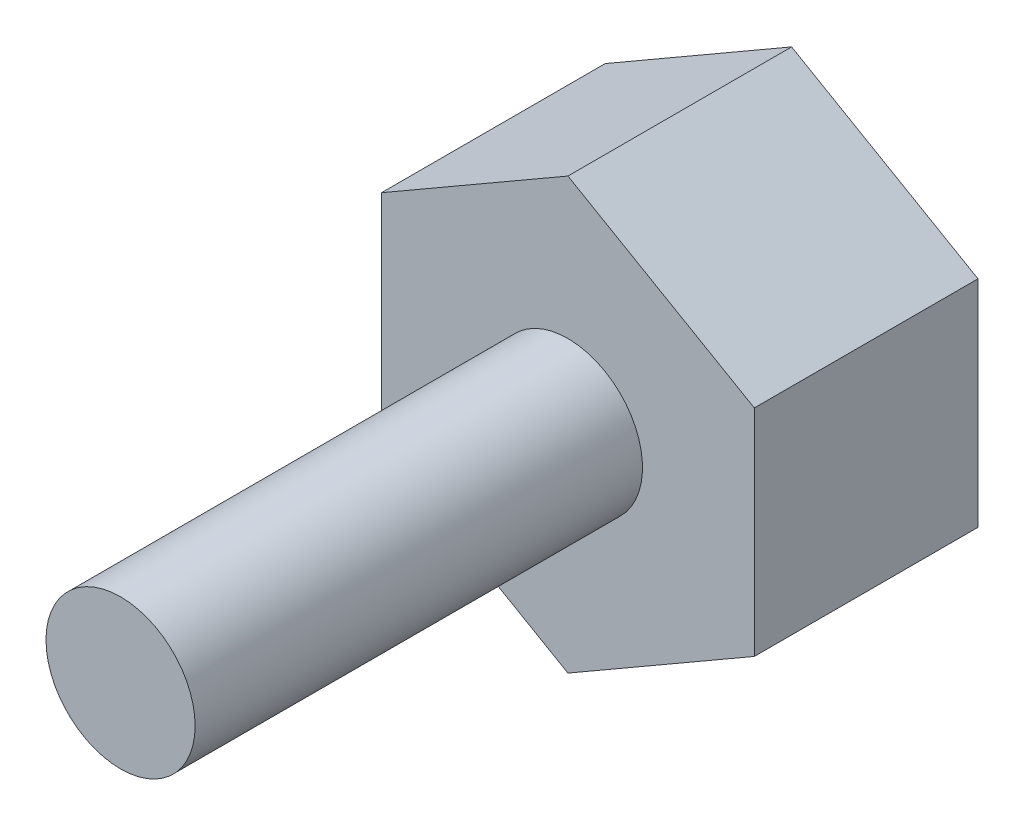
ISO-10303-21;
HEADER;
FILE_DESCRIPTION(('STEP AP214'),'2;1');
FILE_NAME('part.step','',(''),(''),'','','');
FILE_SCHEMA(('AUTOMOTIVE_DESIGN { 1 0 10303 214 1 1 1 1 }'));
ENDSEC;
DATA;
#1=APPLICATION_CONTEXT('core data for automotive mechanical design processes');
#2=APPLICATION_PROTOCOL_DEFINITION('international standard','automotive_design',2000,#1);
#3=PRODUCT_CONTEXT('',#1,'mechanical');
#4=PRODUCT('Part','Part','',(#3));
#5=PRODUCT_RELATED_PRODUCT_CATEGORY('part','',(#4));
#6=PRODUCT_DEFINITION_FORMATION('','',#4);
#7=PRODUCT_DEFINITION_CONTEXT('part definition',#1,'design');
#8=PRODUCT_DEFINITION('design','',#6,#7);
#9=PRODUCT_DEFINITION_SHAPE('','',#8);
#10=(LENGTH_UNIT() NAMED_UNIT(*) SI_UNIT(.MILLI.,.METRE.));
#11=(NAMED_UNIT(*) PLANE_ANGLE_UNIT() SI_UNIT($,.RADIAN.));
#12=(NAMED_UNIT(*) SI_UNIT($,.STERADIAN.) SOLID_ANGLE_UNIT());
#13=UNCERTAINTY_MEASURE_WITH_UNIT(LENGTH_MEASURE(1.E-05),#10,'distance_accuracy_value','');
#14=(GEOMETRIC_REPRESENTATION_CONTEXT(3) GLOBAL_UNCERTAINTY_ASSIGNED_CONTEXT((#13)) GLOBAL_UNIT_ASSIGNED_CONTEXT((#10,
#11,#12)) REPRESENTATION_CONTEXT('',''));
#15=CARTESIAN_POINT('',(0.,0.,0.));
#16=DIRECTION('',(0.,0.,1.));
#17=DIRECTION('',(1.,0.,0.));
#18=AXIS2_PLACEMENT_3D('',#15,#16,#17);
#19=CARTESIAN_POINT('',(-63.4947615904966,14.9787081339713,6.));
#20=DIRECTION('',(0.,0.,-1.));
#21=DIRECTION('',(-1.,0.,0.));
#22=AXIS2_PLACEMENT_3D('',#19,#20,#21);
#23=CYLINDRICAL_SURFACE('',#22,0.999999999999998);
#24=CARTESIAN_POINT('',(-63.4947615904966,14.9787081339713,6.));
#25=DIRECTION('',(0.,0.,1.));
#26=DIRECTION('',(1.,0.,0.));
#27=AXIS2_PLACEMENT_3D('',#24,#25,#26);
#28=CIRCLE('',#27,0.999999999999998);
#29=CARTESIAN_POINT('',(-62.4947615904966,14.9787081339713,6.));
#30=VERTEX_POINT('',#29);
#31=EDGE_CURVE('E11',#30,#30,#28,.T.);
#32=ORIENTED_EDGE('',*,*,#31,.F.);
#33=EDGE_LOOP('',(#32));
#34=FACE_BOUND('',#33,.T.);
#35=CARTESIAN_POINT('',(-63.4947615904966,14.9787081339713,0.));
#36=DIRECTION('',(0.,0.,-1.));
#37=DIRECTION('',(-1.,0.,0.));
#38=AXIS2_PLACEMENT_3D('',#35,#36,#37);
#39=CIRCLE('',#38,0.999999999999998);
#40=CARTESIAN_POINT('',(-64.4947615904966,14.9787081339713,0.));
#41=VERTEX_POINT('',#40);
#42=EDGE_CURVE('E41',#41,#41,#39,.T.);
#43=ORIENTED_EDGE('',*,*,#42,.F.);
#44=EDGE_LOOP('',(#43));
#45=FACE_BOUND('',#44,.T.);
#46=ADVANCED_FACE('F33',(#34,#45),#23,.T.);
#47=CARTESIAN_POINT('',(-63.4947615904966,14.9787081339713,6.));
#48=DIRECTION('',(0.,0.,1.));
#49=DIRECTION('',(1.,0.,0.));
#50=AXIS2_PLACEMENT_3D('',#47,#48,#49);
#51=PLANE('',#50);
#52=ORIENTED_EDGE('',*,*,#31,.T.);
#53=EDGE_LOOP('',(#52));
#54=FACE_BOUND('',#53,.T.);
#55=ADVANCED_FACE('F143',(#54),#51,.T.);
#56=CARTESIAN_POINT('',(-60.9947615904966,13.5353324609972,-3.));
#57=DIRECTION('',(-0.5,0.866025403784439,0.));
#58=DIRECTION('',(-0.866025403784439,-0.5,0.));
#59=AXIS2_PLACEMENT_3D('',#56,#57,#58);
#60=PLANE('',#59);
#61=DIRECTION('',(-0.866025403784439,-0.5,0.));
#62=VECTOR('',#61,1.);
#63=CARTESIAN_POINT('',(-60.9947615904966,13.5353324609972,0.));
#64=LINE('',#63,#62);
#65=CARTESIAN_POINT('',(-60.9947615904966,13.5353324609972,0.));
#66=VERTEX_POINT('',#65);
#67=CARTESIAN_POINT('',(-63.4947615904967,12.0919567880232,0.));
#68=VERTEX_POINT('',#67);
#69=EDGE_CURVE('E118',#66,#68,#64,.T.);
#70=ORIENTED_EDGE('',*,*,#69,.T.);
#71=DIRECTION('',(0.,0.,1.));
#72=VECTOR('',#71,1.);
#73=CARTESIAN_POINT('',(-63.4947615904967,12.0919567880232,-3.));
#74=LINE('',#73,#72);
#75=CARTESIAN_POINT('',(-63.4947615904967,12.0919567880232,-3.));
#76=VERTEX_POINT('',#75);
#77=EDGE_CURVE('E135',#76,#68,#74,.T.);
#78=ORIENTED_EDGE('',*,*,#77,.F.);
#79=DIRECTION('',(-0.866025403784439,-0.5,0.));
#80=VECTOR('',#79,1.);
#81=CARTESIAN_POINT('',(-60.9947615904966,13.5353324609972,-3.));
#82=LINE('',#81,#80);
#83=CARTESIAN_POINT('',(-60.9947615904966,13.5353324609972,-3.));
#84=VERTEX_POINT('',#83);
#85=EDGE_CURVE('E128',#84,#76,#82,.T.);
#86=ORIENTED_EDGE('',*,*,#85,.F.);
#87=DIRECTION('',(0.,0.,1.));
#88=VECTOR('',#87,1.);
#89=CARTESIAN_POINT('',(-60.9947615904966,13.5353324609972,-3.));
#90=LINE('',#89,#88);
#91=EDGE_CURVE('E114',#84,#66,#90,.T.);
#92=ORIENTED_EDGE('',*,*,#91,.T.);
#93=EDGE_LOOP('',(#70,#78,#86,#92));
#94=FACE_BOUND('',#93,.T.);
#95=ADVANCED_FACE('F148',(#94),#60,.F.);
#96=CARTESIAN_POINT('',(-63.4947615904967,12.0919567880232,-3.));
#97=DIRECTION('',(0.5,0.866025403784438,0.));
#98=DIRECTION('',(-0.866025403784438,0.5,0.));
#99=AXIS2_PLACEMENT_3D('',#96,#97,#98);
#100=PLANE('',#99);
#101=DIRECTION('',(-0.866025403784438,0.5,0.));
#102=VECTOR('',#101,1.);
#103=CARTESIAN_POINT('',(-63.4947615904967,12.0919567880232,0.));
#104=LINE('',#103,#102);
#105=CARTESIAN_POINT('',(-65.9947615904966,13.5353324609972,0.));
#106=VERTEX_POINT('',#105);
#107=EDGE_CURVE('E121',#68,#106,#104,.T.);
#108=ORIENTED_EDGE('',*,*,#107,.T.);
#109=DIRECTION('',(0.,0.,1.));
#110=VECTOR('',#109,1.);
#111=CARTESIAN_POINT('',(-65.9947615904966,13.5353324609972,-3.));
#112=LINE('',#111,#110);
#113=CARTESIAN_POINT('',(-65.9947615904966,13.5353324609972,-3.));
#114=VERTEX_POINT('',#113);
#115=EDGE_CURVE('E132',#114,#106,#112,.T.);
#116=ORIENTED_EDGE('',*,*,#115,.F.);
#117=DIRECTION('',(-0.866025403784438,0.5,0.));
#118=VECTOR('',#117,1.);
#119=CARTESIAN_POINT('',(-63.4947615904967,12.0919567880232,-3.));
#120=LINE('',#119,#118);
#121=EDGE_CURVE('E87',#76,#114,#120,.T.);
#122=ORIENTED_EDGE('',*,*,#121,.F.);
#123=ORIENTED_EDGE('',*,*,#77,.T.);
#124=EDGE_LOOP('',(#108,#116,#122,#123));
#125=FACE_BOUND('',#124,.T.);
#126=ADVANCED_FACE('F154',(#125),#100,.F.);
#127=CARTESIAN_POINT('',(-65.9947615904966,13.5353324609972,-3.));
#128=DIRECTION('',(1.,0.,0.));
#129=DIRECTION('',(0.,0.,-1.));
#130=AXIS2_PLACEMENT_3D('',#127,#128,#129);
#131=PLANE('',#130);
#132=DIRECTION('',(0.,1.,0.));
#133=VECTOR('',#132,1.);
#134=CARTESIAN_POINT('',(-65.9947615904966,13.5353324609972,0.));
#135=LINE('',#134,#133);
#136=CARTESIAN_POINT('',(-65.9947615904966,16.4220838069454,0.));
#137=VERTEX_POINT('',#136);
#138=EDGE_CURVE('E123',#106,#137,#135,.T.);
#139=ORIENTED_EDGE('',*,*,#138,.T.);
#140=DIRECTION('',(0.,0.,1.));
#141=VECTOR('',#140,1.);
#142=CARTESIAN_POINT('',(-65.9947615904966,16.4220838069454,-3.));
#143=LINE('',#142,#141);
#144=CARTESIAN_POINT('',(-65.9947615904966,16.4220838069454,-3.));
#145=VERTEX_POINT('',#144);
#146=EDGE_CURVE('E109',#145,#137,#143,.T.);
#147=ORIENTED_EDGE('',*,*,#146,.F.);
#148=DIRECTION('',(0.,1.,0.));
#149=VECTOR('',#148,1.);
#150=CARTESIAN_POINT('',(-65.9947615904966,13.5353324609972,-3.));
#151=LINE('',#150,#149);
#152=EDGE_CURVE('E100',#114,#145,#151,.T.);
#153=ORIENTED_EDGE('',*,*,#152,.F.);
#154=ORIENTED_EDGE('',*,*,#115,.T.);
#155=EDGE_LOOP('',(#139,#147,#153,#154));
#156=FACE_BOUND('',#155,.T.);
#157=ADVANCED_FACE('F160',(#156),#131,.F.);
#158=CARTESIAN_POINT('',(-65.9947615904966,16.4220838069454,-3.));
#159=DIRECTION('',(0.499999999999999,-0.866025403784439,0.));
#160=DIRECTION('',(0.866025403784439,0.499999999999999,0.));
#161=AXIS2_PLACEMENT_3D('',#158,#159,#160);
#162=PLANE('',#161);
#163=DIRECTION('',(0.866025403784439,0.499999999999999,0.));
#164=VECTOR('',#163,1.);
#165=CARTESIAN_POINT('',(-65.9947615904966,16.4220838069454,0.));
#166=LINE('',#165,#164);
#167=CARTESIAN_POINT('',(-63.4947615904966,17.8654594799194,0.));
#168=VERTEX_POINT('',#167);
#169=EDGE_CURVE('E108',#137,#168,#166,.T.);
#170=ORIENTED_EDGE('',*,*,#169,.T.);
#171=DIRECTION('',(0.,0.,1.));
#172=VECTOR('',#171,1.);
#173=CARTESIAN_POINT('',(-63.4947615904966,17.8654594799194,-3.));
#174=LINE('',#173,#172);
#175=CARTESIAN_POINT('',(-63.4947615904966,17.8654594799194,-3.));
#176=VERTEX_POINT('',#175);
#177=EDGE_CURVE('E105',#176,#168,#174,.T.);
#178=ORIENTED_EDGE('',*,*,#177,.F.);
#179=DIRECTION('',(0.866025403784439,0.499999999999999,0.));
#180=VECTOR('',#179,1.);
#181=CARTESIAN_POINT('',(-65.9947615904966,16.4220838069454,-3.));
#182=LINE('',#181,#180);
#183=EDGE_CURVE('E94',#145,#176,#182,.T.);
#184=ORIENTED_EDGE('',*,*,#183,.F.);
#185=ORIENTED_EDGE('',*,*,#146,.T.);
#186=EDGE_LOOP('',(#170,#178,#184,#185));
#187=FACE_BOUND('',#186,.T.);
#188=ADVANCED_FACE('F106',(#187),#162,.F.);
#189=CARTESIAN_POINT('',(-63.4947615904966,17.8654594799194,-3.));
#190=DIRECTION('',(-0.500000000000001,-0.866025403784438,0.));
#191=DIRECTION('',(0.866025403784438,-0.500000000000001,0.));
#192=AXIS2_PLACEMENT_3D('',#189,#190,#191);
#193=PLANE('',#192);
#194=DIRECTION('',(0.866025403784438,-0.500000000000001,0.));
#195=VECTOR('',#194,1.);
#196=CARTESIAN_POINT('',(-63.4947615904966,17.8654594799194,0.));
#197=LINE('',#196,#195);
#198=CARTESIAN_POINT('',(-60.9947615904966,16.4220838069454,0.));
#199=VERTEX_POINT('',#198);
#200=EDGE_CURVE('E72',#168,#199,#197,.T.);
#201=ORIENTED_EDGE('',*,*,#200,.T.);
#202=DIRECTION('',(0.,0.,1.));
#203=VECTOR('',#202,1.);
#204=CARTESIAN_POINT('',(-60.9947615904966,16.4220838069454,-3.));
#205=LINE('',#204,#203);
#206=CARTESIAN_POINT('',(-60.9947615904966,16.4220838069454,-3.));
#207=VERTEX_POINT('',#206);
#208=EDGE_CURVE('E110',#207,#199,#205,.T.);
#209=ORIENTED_EDGE('',*,*,#208,.F.);
#210=DIRECTION('',(0.866025403784438,-0.500000000000001,0.));
#211=VECTOR('',#210,1.);
#212=CARTESIAN_POINT('',(-63.4947615904966,17.8654594799194,-3.));
#213=LINE('',#212,#211);
#214=EDGE_CURVE('E98',#176,#207,#213,.T.);
#215=ORIENTED_EDGE('',*,*,#214,.F.);
#216=ORIENTED_EDGE('',*,*,#177,.T.);
#217=EDGE_LOOP('',(#201,#209,#215,#216));
#218=FACE_BOUND('',#217,.T.);
#219=ADVANCED_FACE('F112',(#218),#193,.F.);
#220=CARTESIAN_POINT('',(-60.9947615904966,16.4220838069454,-3.));
#221=DIRECTION('',(-1.,0.,0.));
#222=DIRECTION('',(0.,0.,1.));
#223=AXIS2_PLACEMENT_3D('',#220,#221,#222);
#224=PLANE('',#223);
#225=DIRECTION('',(0.,-1.,0.));
#226=VECTOR('',#225,1.);
#227=CARTESIAN_POINT('',(-60.9947615904966,16.4220838069454,0.));
#228=LINE('',#227,#226);
#229=EDGE_CURVE('E78',#199,#66,#228,.T.);
#230=ORIENTED_EDGE('',*,*,#229,.T.);
#231=ORIENTED_EDGE('',*,*,#91,.F.);
#232=DIRECTION('',(0.,-1.,0.));
#233=VECTOR('',#232,1.);
#234=CARTESIAN_POINT('',(-60.9947615904966,16.4220838069454,-3.));
#235=LINE('',#234,#233);
#236=EDGE_CURVE('E49',#207,#84,#235,.T.);
#237=ORIENTED_EDGE('',*,*,#236,.F.);
#238=ORIENTED_EDGE('',*,*,#208,.T.);
#239=EDGE_LOOP('',(#230,#231,#237,#238));
#240=FACE_BOUND('',#239,.T.);
#241=ADVANCED_FACE('F168',(#240),#224,.F.);
#242=CARTESIAN_POINT('',(0.,0.,-3.));
#243=DIRECTION('',(0.,0.,-1.));
#244=DIRECTION('',(-1.,0.,0.));
#245=AXIS2_PLACEMENT_3D('',#242,#243,#244);
#246=PLANE('',#245);
#247=ORIENTED_EDGE('',*,*,#85,.T.);
#248=ORIENTED_EDGE('',*,*,#121,.T.);
#249=ORIENTED_EDGE('',*,*,#152,.T.);
#250=ORIENTED_EDGE('',*,*,#183,.T.);
#251=ORIENTED_EDGE('',*,*,#214,.T.);
#252=ORIENTED_EDGE('',*,*,#236,.T.);
#253=EDGE_LOOP('',(#247,#248,#249,#250,#251,#252));
#254=FACE_BOUND('',#253,.T.);
#255=ADVANCED_FACE('F96',(#254),#246,.T.);
#256=CARTESIAN_POINT('',(0.,0.,0.));
#257=DIRECTION('',(0.,0.,-1.));
#258=DIRECTION('',(-1.,0.,0.));
#259=AXIS2_PLACEMENT_3D('',#256,#257,#258);
#260=PLANE('',#259);
#261=ORIENTED_EDGE('',*,*,#42,.T.);
#262=EDGE_LOOP('',(#261));
#263=FACE_BOUND('',#262,.T.);
#264=ORIENTED_EDGE('',*,*,#69,.F.);
#265=ORIENTED_EDGE('',*,*,#229,.F.);
#266=ORIENTED_EDGE('',*,*,#200,.F.);
#267=ORIENTED_EDGE('',*,*,#169,.F.);
#268=ORIENTED_EDGE('',*,*,#138,.F.);
#269=ORIENTED_EDGE('',*,*,#107,.F.);
#270=EDGE_LOOP('',(#264,#265,#266,#267,#268,#269));
#271=FACE_BOUND('',#270,.T.);
#272=ADVANCED_FACE('F139',(#263,#271),#260,.F.);
#273=CLOSED_SHELL('',(#46,#55,#95,#126,#157,#188,#219,#241,#255,#272));
#274=MANIFOLD_SOLID_BREP('B2',#273);
#275=ADVANCED_BREP_SHAPE_REPRESENTATION('',(#18,#274),#14);
#276=SHAPE_DEFINITION_REPRESENTATION(#9,#275);
ENDSEC;
END-ISO-10303-21;
